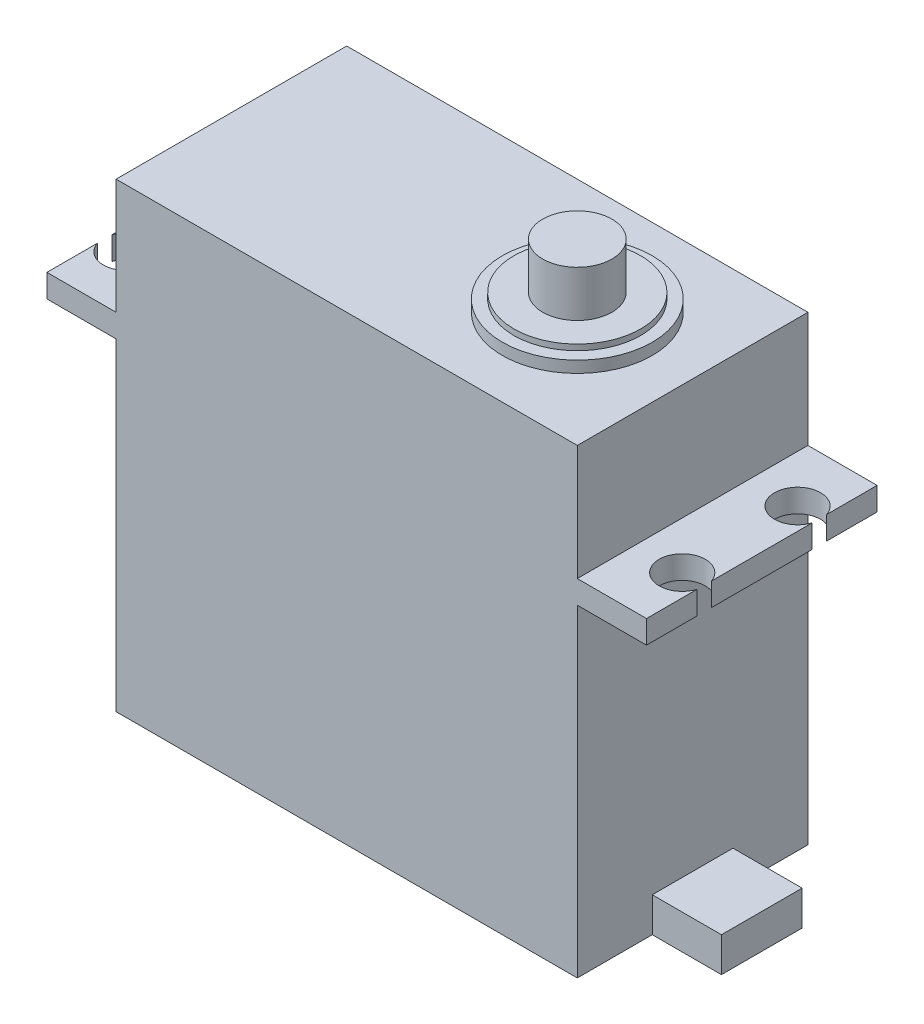
ISO-10303-21;
HEADER;
FILE_DESCRIPTION(('STEP AP214'),'2;1');
FILE_NAME('part.step','',(''),(''),'','','');
FILE_SCHEMA(('AUTOMOTIVE_DESIGN { 1 0 10303 214 1 1 1 1 }'));
ENDSEC;
DATA;
#1=APPLICATION_CONTEXT('core data for automotive mechanical design processes');
#2=APPLICATION_PROTOCOL_DEFINITION('international standard','automotive_design',2000,#1);
#3=PRODUCT_CONTEXT('',#1,'mechanical');
#4=PRODUCT('Part','Part','',(#3));
#5=PRODUCT_RELATED_PRODUCT_CATEGORY('part','',(#4));
#6=PRODUCT_DEFINITION_FORMATION('','',#4);
#7=PRODUCT_DEFINITION_CONTEXT('part definition',#1,'design');
#8=PRODUCT_DEFINITION('design','',#6,#7);
#9=PRODUCT_DEFINITION_SHAPE('','',#8);
#10=(LENGTH_UNIT() NAMED_UNIT(*) SI_UNIT(.MILLI.,.METRE.));
#11=(NAMED_UNIT(*) PLANE_ANGLE_UNIT() SI_UNIT($,.RADIAN.));
#12=(NAMED_UNIT(*) SI_UNIT($,.STERADIAN.) SOLID_ANGLE_UNIT());
#13=UNCERTAINTY_MEASURE_WITH_UNIT(LENGTH_MEASURE(1.E-05),#10,'distance_accuracy_value','');
#14=(GEOMETRIC_REPRESENTATION_CONTEXT(3) GLOBAL_UNCERTAINTY_ASSIGNED_CONTEXT((#13)) GLOBAL_UNIT_ASSIGNED_CONTEXT((#10,
#11,#12)) REPRESENTATION_CONTEXT('',''));
#15=CARTESIAN_POINT('',(0.,0.,0.));
#16=DIRECTION('',(0.,0.,1.));
#17=DIRECTION('',(1.,0.,0.));
#18=AXIS2_PLACEMENT_3D('',#15,#16,#17);
#19=CARTESIAN_POINT('',(26.,0.,0.));
#20=DIRECTION('',(1.,0.,0.));
#21=DIRECTION('',(0.,0.,-1.));
#22=AXIS2_PLACEMENT_3D('',#19,#20,#21);
#23=PLANE('',#22);
#24=DIRECTION('',(0.,1.,0.));
#25=VECTOR('',#24,1.);
#26=CARTESIAN_POINT('',(26.,24.,4.37550020016015));
#27=LINE('',#26,#25);
#28=CARTESIAN_POINT('',(26.,28.,4.37550020016015));
#29=VERTEX_POINT('',#28);
#30=CARTESIAN_POINT('',(26.,30.,4.37550020016015));
#31=VERTEX_POINT('',#30);
#32=EDGE_CURVE('E306',#29,#31,#27,.T.);
#33=ORIENTED_EDGE('',*,*,#32,.F.);
#34=DIRECTION('',(0.,0.,-1.));
#35=VECTOR('',#34,1.);
#36=CARTESIAN_POINT('',(26.,28.,10.));
#37=LINE('',#36,#35);
#38=CARTESIAN_POINT('',(26.,28.,-4.37550020016015));
#39=VERTEX_POINT('',#38);
#40=EDGE_CURVE('E384',#29,#39,#37,.T.);
#41=ORIENTED_EDGE('',*,*,#40,.T.);
#42=DIRECTION('',(0.,1.,0.));
#43=VECTOR('',#42,1.);
#44=CARTESIAN_POINT('',(26.,24.,-4.37550020016015));
#45=LINE('',#44,#43);
#46=CARTESIAN_POINT('',(26.,30.,-4.37550020016015));
#47=VERTEX_POINT('',#46);
#48=EDGE_CURVE('E313',#47,#39,#45,.F.);
#49=ORIENTED_EDGE('',*,*,#48,.F.);
#50=DIRECTION('',(0.,0.,1.));
#51=VECTOR('',#50,1.);
#52=CARTESIAN_POINT('',(26.,30.,10.));
#53=LINE('',#52,#51);
#54=EDGE_CURVE('E377',#47,#31,#53,.T.);
#55=ORIENTED_EDGE('',*,*,#54,.T.);
#56=EDGE_LOOP('',(#33,#41,#49,#55));
#57=FACE_BOUND('',#56,.T.);
#58=ADVANCED_FACE('F34',(#57),#23,.T.);
#59=DIRECTION('',(0.,1.,0.));
#60=VECTOR('',#59,1.);
#61=CARTESIAN_POINT('',(26.,24.,-5.62449979983985));
#62=LINE('',#61,#60);
#63=CARTESIAN_POINT('',(26.,28.,-5.62449979983985));
#64=VERTEX_POINT('',#63);
#65=CARTESIAN_POINT('',(26.,30.,-5.62449979983985));
#66=VERTEX_POINT('',#65);
#67=EDGE_CURVE('E309',#64,#66,#62,.T.);
#68=ORIENTED_EDGE('',*,*,#67,.F.);
#69=CARTESIAN_POINT('',(26.,28.,-10.));
#70=VERTEX_POINT('',#69);
#71=EDGE_CURVE('E385',#64,#70,#37,.T.);
#72=ORIENTED_EDGE('',*,*,#71,.T.);
#73=DIRECTION('',(0.,1.,0.));
#74=VECTOR('',#73,1.);
#75=CARTESIAN_POINT('',(26.,30.,-10.));
#76=LINE('',#75,#74);
#77=CARTESIAN_POINT('',(26.,30.,-10.));
#78=VERTEX_POINT('',#77);
#79=EDGE_CURVE('E379',#70,#78,#76,.T.);
#80=ORIENTED_EDGE('',*,*,#79,.T.);
#81=EDGE_CURVE('E366',#78,#66,#53,.T.);
#82=ORIENTED_EDGE('',*,*,#81,.T.);
#83=EDGE_LOOP('',(#68,#72,#80,#82));
#84=FACE_BOUND('',#83,.T.);
#85=ADVANCED_FACE('F451',(#84),#23,.T.);
#86=CARTESIAN_POINT('',(-26.,0.,0.));
#87=DIRECTION('',(-1.,0.,0.));
#88=DIRECTION('',(0.,0.,1.));
#89=AXIS2_PLACEMENT_3D('',#86,#87,#88);
#90=PLANE('',#89);
#91=DIRECTION('',(0.,1.,0.));
#92=VECTOR('',#91,1.);
#93=CARTESIAN_POINT('',(-26.,24.,-4.37550020016015));
#94=LINE('',#93,#92);
#95=CARTESIAN_POINT('',(-26.,28.,-4.37550020016015));
#96=VERTEX_POINT('',#95);
#97=CARTESIAN_POINT('',(-26.,30.,-4.37550020016015));
#98=VERTEX_POINT('',#97);
#99=EDGE_CURVE('E315',#96,#98,#94,.T.);
#100=ORIENTED_EDGE('',*,*,#99,.F.);
#101=DIRECTION('',(0.,0.,1.));
#102=VECTOR('',#101,1.);
#103=CARTESIAN_POINT('',(-26.,28.,-10.));
#104=LINE('',#103,#102);
#105=CARTESIAN_POINT('',(-26.,28.,4.37550020016015));
#106=VERTEX_POINT('',#105);
#107=EDGE_CURVE('E240',#96,#106,#104,.T.);
#108=ORIENTED_EDGE('',*,*,#107,.T.);
#109=DIRECTION('',(0.,1.,0.));
#110=VECTOR('',#109,1.);
#111=CARTESIAN_POINT('',(-26.,24.,4.37550020016015));
#112=LINE('',#111,#110);
#113=CARTESIAN_POINT('',(-26.,30.,4.37550020016015));
#114=VERTEX_POINT('',#113);
#115=EDGE_CURVE('E207',#114,#106,#112,.F.);
#116=ORIENTED_EDGE('',*,*,#115,.F.);
#117=DIRECTION('',(0.,0.,-1.));
#118=VECTOR('',#117,1.);
#119=CARTESIAN_POINT('',(-26.,30.,-10.));
#120=LINE('',#119,#118);
#121=EDGE_CURVE('E218',#114,#98,#120,.T.);
#122=ORIENTED_EDGE('',*,*,#121,.T.);
#123=EDGE_LOOP('',(#100,#108,#116,#122));
#124=FACE_BOUND('',#123,.T.);
#125=ADVANCED_FACE('F449',(#124),#90,.T.);
#126=DIRECTION('',(0.,1.,0.));
#127=VECTOR('',#126,1.);
#128=CARTESIAN_POINT('',(-26.,24.,5.62449979983985));
#129=LINE('',#128,#127);
#130=CARTESIAN_POINT('',(-26.,28.,5.62449979983985));
#131=VERTEX_POINT('',#130);
#132=CARTESIAN_POINT('',(-26.,30.,5.62449979983985));
#133=VERTEX_POINT('',#132);
#134=EDGE_CURVE('E196',#131,#133,#129,.T.);
#135=ORIENTED_EDGE('',*,*,#134,.F.);
#136=CARTESIAN_POINT('',(-26.,28.,10.));
#137=VERTEX_POINT('',#136);
#138=EDGE_CURVE('E242',#131,#137,#104,.T.);
#139=ORIENTED_EDGE('',*,*,#138,.T.);
#140=DIRECTION('',(0.,1.,0.));
#141=VECTOR('',#140,1.);
#142=CARTESIAN_POINT('',(-26.,30.,10.));
#143=LINE('',#142,#141);
#144=CARTESIAN_POINT('',(-26.,30.,10.));
#145=VERTEX_POINT('',#144);
#146=EDGE_CURVE('E224',#137,#145,#143,.T.);
#147=ORIENTED_EDGE('',*,*,#146,.T.);
#148=EDGE_CURVE('E215',#145,#133,#120,.T.);
#149=ORIENTED_EDGE('',*,*,#148,.T.);
#150=EDGE_LOOP('',(#135,#139,#147,#149));
#151=FACE_BOUND('',#150,.T.);
#152=ADVANCED_FACE('F222',(#151),#90,.T.);
#153=CARTESIAN_POINT('',(-20.,40.,10.));
#154=DIRECTION('',(1.,0.,0.));
#155=DIRECTION('',(0.,0.,-1.));
#156=AXIS2_PLACEMENT_3D('',#153,#154,#155);
#157=PLANE('',#156);
#158=DIRECTION('',(0.,0.,-1.));
#159=VECTOR('',#158,1.);
#160=CARTESIAN_POINT('',(-20.,30.,-10.));
#161=LINE('',#160,#159);
#162=CARTESIAN_POINT('',(-20.,30.,10.));
#163=VERTEX_POINT('',#162);
#164=CARTESIAN_POINT('',(-20.,30.,-10.));
#165=VERTEX_POINT('',#164);
#166=EDGE_CURVE('E246',#163,#165,#161,.T.);
#167=ORIENTED_EDGE('',*,*,#166,.F.);
#168=DIRECTION('',(0.,-1.,0.));
#169=VECTOR('',#168,1.);
#170=CARTESIAN_POINT('',(-20.,40.,10.));
#171=LINE('',#170,#169);
#172=CARTESIAN_POINT('',(-20.,40.,10.));
#173=VERTEX_POINT('',#172);
#174=EDGE_CURVE('E326',#173,#163,#171,.T.);
#175=ORIENTED_EDGE('',*,*,#174,.F.);
#176=DIRECTION('',(0.,0.,1.));
#177=VECTOR('',#176,1.);
#178=CARTESIAN_POINT('',(-20.,40.,10.));
#179=LINE('',#178,#177);
#180=CARTESIAN_POINT('',(-20.,40.,-10.));
#181=VERTEX_POINT('',#180);
#182=EDGE_CURVE('E348',#181,#173,#179,.T.);
#183=ORIENTED_EDGE('',*,*,#182,.F.);
#184=DIRECTION('',(0.,-1.,0.));
#185=VECTOR('',#184,1.);
#186=CARTESIAN_POINT('',(-20.,40.,-10.));
#187=LINE('',#186,#185);
#188=EDGE_CURVE('E323',#181,#165,#187,.T.);
#189=ORIENTED_EDGE('',*,*,#188,.T.);
#190=EDGE_LOOP('',(#167,#175,#183,#189));
#191=FACE_BOUND('',#190,.T.);
#192=ADVANCED_FACE('F457',(#191),#157,.F.);
#193=DIRECTION('',(0.,0.,1.));
#194=VECTOR('',#193,1.);
#195=CARTESIAN_POINT('',(-20.,28.,-10.));
#196=LINE('',#195,#194);
#197=CARTESIAN_POINT('',(-20.,28.,-10.));
#198=VERTEX_POINT('',#197);
#199=CARTESIAN_POINT('',(-20.,28.,10.));
#200=VERTEX_POINT('',#199);
#201=EDGE_CURVE('E250',#198,#200,#196,.T.);
#202=ORIENTED_EDGE('',*,*,#201,.F.);
#203=CARTESIAN_POINT('',(-20.,0.,-10.));
#204=VERTEX_POINT('',#203);
#205=EDGE_CURVE('E325',#198,#204,#187,.T.);
#206=ORIENTED_EDGE('',*,*,#205,.T.);
#207=DIRECTION('',(0.,0.,1.));
#208=VECTOR('',#207,1.);
#209=CARTESIAN_POINT('',(-20.,0.,10.));
#210=LINE('',#209,#208);
#211=CARTESIAN_POINT('',(-20.,0.,10.));
#212=VERTEX_POINT('',#211);
#213=EDGE_CURVE('E337',#204,#212,#210,.T.);
#214=ORIENTED_EDGE('',*,*,#213,.T.);
#215=EDGE_CURVE('E329',#200,#212,#171,.T.);
#216=ORIENTED_EDGE('',*,*,#215,.F.);
#217=EDGE_LOOP('',(#202,#206,#214,#216));
#218=FACE_BOUND('',#217,.T.);
#219=ADVANCED_FACE('F593',(#218),#157,.F.);
#220=CARTESIAN_POINT('',(20.,40.,10.));
#221=DIRECTION('',(-1.,0.,0.));
#222=DIRECTION('',(0.,0.,1.));
#223=AXIS2_PLACEMENT_3D('',#220,#221,#222);
#224=PLANE('',#223);
#225=DIRECTION('',(0.,-1.,0.));
#226=VECTOR('',#225,1.);
#227=CARTESIAN_POINT('',(20.,3.,3.5));
#228=LINE('',#227,#226);
#229=CARTESIAN_POINT('',(20.,3.00000000000001,3.5));
#230=VERTEX_POINT('',#229);
#231=CARTESIAN_POINT('',(20.,0.,3.5));
#232=VERTEX_POINT('',#231);
#233=EDGE_CURVE('E407',#230,#232,#228,.T.);
#234=ORIENTED_EDGE('',*,*,#233,.F.);
#235=DIRECTION('',(0.,0.,1.));
#236=VECTOR('',#235,1.);
#237=CARTESIAN_POINT('',(20.,3.,3.5));
#238=LINE('',#237,#236);
#239=CARTESIAN_POINT('',(20.,3.00000000000001,-3.5));
#240=VERTEX_POINT('',#239);
#241=EDGE_CURVE('E400',#240,#230,#238,.T.);
#242=ORIENTED_EDGE('',*,*,#241,.F.);
#243=DIRECTION('',(0.,1.,0.));
#244=VECTOR('',#243,1.);
#245=CARTESIAN_POINT('',(20.,3.00000000000001,-3.5));
#246=LINE('',#245,#244);
#247=CARTESIAN_POINT('',(20.,0.,-3.5));
#248=VERTEX_POINT('',#247);
#249=EDGE_CURVE('E404',#248,#240,#246,.T.);
#250=ORIENTED_EDGE('',*,*,#249,.F.);
#251=DIRECTION('',(0.,0.,-1.));
#252=VECTOR('',#251,1.);
#253=CARTESIAN_POINT('',(20.,0.,10.));
#254=LINE('',#253,#252);
#255=CARTESIAN_POINT('',(20.,0.,-10.));
#256=VERTEX_POINT('',#255);
#257=EDGE_CURVE('E345',#248,#256,#254,.T.);
#258=ORIENTED_EDGE('',*,*,#257,.T.);
#259=DIRECTION('',(0.,-1.,0.));
#260=VECTOR('',#259,1.);
#261=CARTESIAN_POINT('',(20.,40.,-10.));
#262=LINE('',#261,#260);
#263=CARTESIAN_POINT('',(20.,28.,-10.));
#264=VERTEX_POINT('',#263);
#265=EDGE_CURVE('E322',#264,#256,#262,.T.);
#266=ORIENTED_EDGE('',*,*,#265,.F.);
#267=DIRECTION('',(0.,0.,-1.));
#268=VECTOR('',#267,1.);
#269=CARTESIAN_POINT('',(20.,28.,10.));
#270=LINE('',#269,#268);
#271=CARTESIAN_POINT('',(20.,28.,10.));
#272=VERTEX_POINT('',#271);
#273=EDGE_CURVE('E371',#272,#264,#270,.T.);
#274=ORIENTED_EDGE('',*,*,#273,.F.);
#275=DIRECTION('',(0.,-1.,0.));
#276=VECTOR('',#275,1.);
#277=CARTESIAN_POINT('',(20.,40.,10.));
#278=LINE('',#277,#276);
#279=CARTESIAN_POINT('',(20.,0.,10.));
#280=VERTEX_POINT('',#279);
#281=EDGE_CURVE('E332',#272,#280,#278,.T.);
#282=ORIENTED_EDGE('',*,*,#281,.T.);
#283=EDGE_CURVE('E343',#280,#232,#254,.T.);
#284=ORIENTED_EDGE('',*,*,#283,.T.);
#285=EDGE_LOOP('',(#234,#242,#250,#258,#266,#274,#282,#284));
#286=FACE_BOUND('',#285,.T.);
#287=ADVANCED_FACE('F585',(#286),#224,.F.);
#288=DIRECTION('',(0.,0.,1.));
#289=VECTOR('',#288,1.);
#290=CARTESIAN_POINT('',(20.,30.,10.));
#291=LINE('',#290,#289);
#292=CARTESIAN_POINT('',(20.,30.,-10.));
#293=VERTEX_POINT('',#292);
#294=CARTESIAN_POINT('',(20.,30.,10.));
#295=VERTEX_POINT('',#294);
#296=EDGE_CURVE('E367',#293,#295,#291,.T.);
#297=ORIENTED_EDGE('',*,*,#296,.F.);
#298=CARTESIAN_POINT('',(20.,40.,-10.));
#299=VERTEX_POINT('',#298);
#300=EDGE_CURVE('E319',#299,#293,#262,.T.);
#301=ORIENTED_EDGE('',*,*,#300,.F.);
#302=DIRECTION('',(0.,0.,-1.));
#303=VECTOR('',#302,1.);
#304=CARTESIAN_POINT('',(20.,40.,10.));
#305=LINE('',#304,#303);
#306=CARTESIAN_POINT('',(20.,40.,10.));
#307=VERTEX_POINT('',#306);
#308=EDGE_CURVE('E336',#307,#299,#305,.T.);
#309=ORIENTED_EDGE('',*,*,#308,.F.);
#310=EDGE_CURVE('E330',#307,#295,#278,.T.);
#311=ORIENTED_EDGE('',*,*,#310,.T.);
#312=EDGE_LOOP('',(#297,#301,#309,#311));
#313=FACE_BOUND('',#312,.T.);
#314=ADVANCED_FACE('F36',(#313),#224,.F.);
#315=CARTESIAN_POINT('',(-20.,40.,-10.));
#316=DIRECTION('',(0.,0.,1.));
#317=DIRECTION('',(1.,0.,0.));
#318=AXIS2_PLACEMENT_3D('',#315,#316,#317);
#319=PLANE('',#318);
#320=DIRECTION('',(-1.,0.,0.));
#321=VECTOR('',#320,1.);
#322=CARTESIAN_POINT('',(-20.,0.,-10.));
#323=LINE('',#322,#321);
#324=EDGE_CURVE('E340',#256,#204,#323,.T.);
#325=ORIENTED_EDGE('',*,*,#324,.T.);
#326=ORIENTED_EDGE('',*,*,#205,.F.);
#327=DIRECTION('',(1.,0.,0.));
#328=VECTOR('',#327,1.);
#329=CARTESIAN_POINT('',(-26.,28.,-10.));
#330=LINE('',#329,#328);
#331=CARTESIAN_POINT('',(-26.,28.,-10.));
#332=VERTEX_POINT('',#331);
#333=EDGE_CURVE('E410',#332,#198,#330,.T.);
#334=ORIENTED_EDGE('',*,*,#333,.F.);
#335=DIRECTION('',(0.,-1.,0.));
#336=VECTOR('',#335,1.);
#337=CARTESIAN_POINT('',(-26.,30.,-10.));
#338=LINE('',#337,#336);
#339=CARTESIAN_POINT('',(-26.,30.,-10.));
#340=VERTEX_POINT('',#339);
#341=EDGE_CURVE('E244',#340,#332,#338,.T.);
#342=ORIENTED_EDGE('',*,*,#341,.F.);
#343=DIRECTION('',(1.,0.,0.));
#344=VECTOR('',#343,1.);
#345=CARTESIAN_POINT('',(-26.,30.,-10.));
#346=LINE('',#345,#344);
#347=EDGE_CURVE('E226',#340,#165,#346,.T.);
#348=ORIENTED_EDGE('',*,*,#347,.T.);
#349=ORIENTED_EDGE('',*,*,#188,.F.);
#350=DIRECTION('',(-1.,0.,0.));
#351=VECTOR('',#350,1.);
#352=CARTESIAN_POINT('',(-20.,40.,-10.));
#353=LINE('',#352,#351);
#354=EDGE_CURVE('E350',#299,#181,#353,.T.);
#355=ORIENTED_EDGE('',*,*,#354,.F.);
#356=ORIENTED_EDGE('',*,*,#300,.T.);
#357=DIRECTION('',(-1.,0.,0.));
#358=VECTOR('',#357,1.);
#359=CARTESIAN_POINT('',(26.,30.,-10.));
#360=LINE('',#359,#358);
#361=EDGE_CURVE('E360',#78,#293,#360,.T.);
#362=ORIENTED_EDGE('',*,*,#361,.F.);
#363=ORIENTED_EDGE('',*,*,#79,.F.);
#364=DIRECTION('',(-1.,0.,0.));
#365=VECTOR('',#364,1.);
#366=CARTESIAN_POINT('',(26.,28.,-10.));
#367=LINE('',#366,#365);
#368=EDGE_CURVE('E357',#70,#264,#367,.T.);
#369=ORIENTED_EDGE('',*,*,#368,.T.);
#370=ORIENTED_EDGE('',*,*,#265,.T.);
#371=EDGE_LOOP('',(#325,#326,#334,#342,#348,#349,#355,#356,#362,#363,#369,#370));
#372=FACE_BOUND('',#371,.T.);
#373=ADVANCED_FACE('F441',(#372),#319,.F.);
#374=CARTESIAN_POINT('',(-20.,40.,10.));
#375=DIRECTION('',(0.,0.,-1.));
#376=DIRECTION('',(-1.,0.,0.));
#377=AXIS2_PLACEMENT_3D('',#374,#375,#376);
#378=PLANE('',#377);
#379=DIRECTION('',(1.,0.,0.));
#380=VECTOR('',#379,1.);
#381=CARTESIAN_POINT('',(-20.,0.,10.));
#382=LINE('',#381,#380);
#383=EDGE_CURVE('E333',#212,#280,#382,.T.);
#384=ORIENTED_EDGE('',*,*,#383,.T.);
#385=ORIENTED_EDGE('',*,*,#281,.F.);
#386=DIRECTION('',(-1.,0.,0.));
#387=VECTOR('',#386,1.);
#388=CARTESIAN_POINT('',(26.,28.,10.));
#389=LINE('',#388,#387);
#390=CARTESIAN_POINT('',(26.,28.,10.));
#391=VERTEX_POINT('',#390);
#392=EDGE_CURVE('E354',#391,#272,#389,.T.);
#393=ORIENTED_EDGE('',*,*,#392,.F.);
#394=DIRECTION('',(0.,-1.,0.));
#395=VECTOR('',#394,1.);
#396=CARTESIAN_POINT('',(26.,30.,10.));
#397=LINE('',#396,#395);
#398=CARTESIAN_POINT('',(26.,30.,10.));
#399=VERTEX_POINT('',#398);
#400=EDGE_CURVE('E370',#399,#391,#397,.T.);
#401=ORIENTED_EDGE('',*,*,#400,.F.);
#402=DIRECTION('',(-1.,0.,0.));
#403=VECTOR('',#402,1.);
#404=CARTESIAN_POINT('',(26.,30.,10.));
#405=LINE('',#404,#403);
#406=EDGE_CURVE('E363',#399,#295,#405,.T.);
#407=ORIENTED_EDGE('',*,*,#406,.T.);
#408=ORIENTED_EDGE('',*,*,#310,.F.);
#409=DIRECTION('',(1.,0.,0.));
#410=VECTOR('',#409,1.);
#411=CARTESIAN_POINT('',(-20.,40.,10.));
#412=LINE('',#411,#410);
#413=EDGE_CURVE('E346',#173,#307,#412,.T.);
#414=ORIENTED_EDGE('',*,*,#413,.F.);
#415=ORIENTED_EDGE('',*,*,#174,.T.);
#416=DIRECTION('',(1.,0.,0.));
#417=VECTOR('',#416,1.);
#418=CARTESIAN_POINT('',(-26.,30.,10.));
#419=LINE('',#418,#417);
#420=EDGE_CURVE('E230',#145,#163,#419,.T.);
#421=ORIENTED_EDGE('',*,*,#420,.F.);
#422=ORIENTED_EDGE('',*,*,#146,.F.);
#423=DIRECTION('',(1.,0.,0.));
#424=VECTOR('',#423,1.);
#425=CARTESIAN_POINT('',(-26.,28.,10.));
#426=LINE('',#425,#424);
#427=EDGE_CURVE('E420',#137,#200,#426,.T.);
#428=ORIENTED_EDGE('',*,*,#427,.T.);
#429=ORIENTED_EDGE('',*,*,#215,.T.);
#430=EDGE_LOOP('',(#384,#385,#393,#401,#407,#408,#414,#415,#421,#422,#428,#429));
#431=FACE_BOUND('',#430,.T.);
#432=ADVANCED_FACE('F434',(#431),#378,.F.);
#433=CARTESIAN_POINT('',(0.,40.,0.));
#434=DIRECTION('',(0.,-1.,0.));
#435=DIRECTION('',(0.,0.,-1.));
#436=AXIS2_PLACEMENT_3D('',#433,#434,#435);
#437=PLANE('',#436);
#438=CARTESIAN_POINT('',(10.,40.,0.));
#439=DIRECTION('',(0.,-1.,0.));
#440=DIRECTION('',(0.,0.,-1.));
#441=AXIS2_PLACEMENT_3D('',#438,#439,#440);
#442=CIRCLE('',#441,6.5);
#443=CARTESIAN_POINT('',(10.,40.,-6.5));
#444=VERTEX_POINT('',#443);
#445=EDGE_CURVE('E38',#444,#444,#442,.F.);
#446=ORIENTED_EDGE('',*,*,#445,.F.);
#447=EDGE_LOOP('',(#446));
#448=FACE_BOUND('',#447,.T.);
#449=ORIENTED_EDGE('',*,*,#308,.T.);
#450=ORIENTED_EDGE('',*,*,#354,.T.);
#451=ORIENTED_EDGE('',*,*,#182,.T.);
#452=ORIENTED_EDGE('',*,*,#413,.T.);
#453=EDGE_LOOP('',(#449,#450,#451,#452));
#454=FACE_BOUND('',#453,.T.);
#455=ADVANCED_FACE('F570',(#448,#454),#437,.F.);
#456=CARTESIAN_POINT('',(0.,0.,0.));
#457=DIRECTION('',(0.,-1.,0.));
#458=DIRECTION('',(0.,0.,-1.));
#459=AXIS2_PLACEMENT_3D('',#456,#457,#458);
#460=PLANE('',#459);
#461=ORIENTED_EDGE('',*,*,#283,.F.);
#462=ORIENTED_EDGE('',*,*,#383,.F.);
#463=ORIENTED_EDGE('',*,*,#213,.F.);
#464=ORIENTED_EDGE('',*,*,#324,.F.);
#465=ORIENTED_EDGE('',*,*,#257,.F.);
#466=DIRECTION('',(-1.,0.,0.));
#467=VECTOR('',#466,1.);
#468=CARTESIAN_POINT('',(26.,0.,-3.5));
#469=LINE('',#468,#467);
#470=CARTESIAN_POINT('',(26.,0.,-3.5));
#471=VERTEX_POINT('',#470);
#472=EDGE_CURVE('E390',#471,#248,#469,.T.);
#473=ORIENTED_EDGE('',*,*,#472,.F.);
#474=DIRECTION('',(0.,0.,-1.));
#475=VECTOR('',#474,1.);
#476=CARTESIAN_POINT('',(26.,0.,3.50000000000001));
#477=LINE('',#476,#475);
#478=CARTESIAN_POINT('',(26.,0.,3.50000000000001));
#479=VERTEX_POINT('',#478);
#480=EDGE_CURVE('E414',#479,#471,#477,.T.);
#481=ORIENTED_EDGE('',*,*,#480,.F.);
#482=DIRECTION('',(-1.,0.,0.));
#483=VECTOR('',#482,1.);
#484=CARTESIAN_POINT('',(26.,0.,3.50000000000001));
#485=LINE('',#484,#483);
#486=EDGE_CURVE('E374',#479,#232,#485,.T.);
#487=ORIENTED_EDGE('',*,*,#486,.T.);
#488=EDGE_LOOP('',(#461,#462,#463,#464,#465,#473,#481,#487));
#489=FACE_BOUND('',#488,.T.);
#490=ADVANCED_FACE('F565',(#489),#460,.T.);
#491=CARTESIAN_POINT('',(26.,28.,10.));
#492=DIRECTION('',(0.,1.,0.));
#493=DIRECTION('',(0.,0.,1.));
#494=AXIS2_PLACEMENT_3D('',#491,#492,#493);
#495=PLANE('',#494);
#496=ORIENTED_EDGE('',*,*,#40,.F.);
#497=CARTESIAN_POINT('',(24.1,28.,5.));
#498=DIRECTION('',(0.,1.,0.));
#499=DIRECTION('',(0.,0.,1.));
#500=AXIS2_PLACEMENT_3D('',#497,#498,#499);
#501=CIRCLE('',#500,2.);
#502=CARTESIAN_POINT('',(26.,28.,5.62449979983985));
#503=VERTEX_POINT('',#502);
#504=EDGE_CURVE('E247',#29,#503,#501,.T.);
#505=ORIENTED_EDGE('',*,*,#504,.T.);
#506=EDGE_CURVE('E381',#391,#503,#37,.T.);
#507=ORIENTED_EDGE('',*,*,#506,.F.);
#508=ORIENTED_EDGE('',*,*,#392,.T.);
#509=ORIENTED_EDGE('',*,*,#273,.T.);
#510=ORIENTED_EDGE('',*,*,#368,.F.);
#511=ORIENTED_EDGE('',*,*,#71,.F.);
#512=CARTESIAN_POINT('',(24.1,28.,-5.));
#513=DIRECTION('',(0.,1.,0.));
#514=DIRECTION('',(0.,0.,1.));
#515=AXIS2_PLACEMENT_3D('',#512,#513,#514);
#516=CIRCLE('',#515,2.);
#517=EDGE_CURVE('E251',#64,#39,#516,.T.);
#518=ORIENTED_EDGE('',*,*,#517,.T.);
#519=EDGE_LOOP('',(#496,#505,#507,#508,#509,#510,#511,#518));
#520=FACE_BOUND('',#519,.T.);
#521=ADVANCED_FACE('F480',(#520),#495,.F.);
#522=CARTESIAN_POINT('',(26.,30.,10.));
#523=DIRECTION('',(0.,-1.,0.));
#524=DIRECTION('',(0.,0.,-1.));
#525=AXIS2_PLACEMENT_3D('',#522,#523,#524);
#526=PLANE('',#525);
#527=CARTESIAN_POINT('',(26.,30.,5.62449979983985));
#528=VERTEX_POINT('',#527);
#529=EDGE_CURVE('E378',#528,#399,#53,.T.);
#530=ORIENTED_EDGE('',*,*,#529,.F.);
#531=CARTESIAN_POINT('',(24.1,30.,5.));
#532=DIRECTION('',(0.,1.,0.));
#533=DIRECTION('',(0.,0.,1.));
#534=AXIS2_PLACEMENT_3D('',#531,#532,#533);
#535=CIRCLE('',#534,2.);
#536=EDGE_CURVE('E51',#31,#528,#535,.T.);
#537=ORIENTED_EDGE('',*,*,#536,.F.);
#538=ORIENTED_EDGE('',*,*,#54,.F.);
#539=CARTESIAN_POINT('',(24.1,30.,-5.));
#540=DIRECTION('',(0.,1.,0.));
#541=DIRECTION('',(0.,0.,1.));
#542=AXIS2_PLACEMENT_3D('',#539,#540,#541);
#543=CIRCLE('',#542,2.);
#544=EDGE_CURVE('E59',#66,#47,#543,.T.);
#545=ORIENTED_EDGE('',*,*,#544,.F.);
#546=ORIENTED_EDGE('',*,*,#81,.F.);
#547=ORIENTED_EDGE('',*,*,#361,.T.);
#548=ORIENTED_EDGE('',*,*,#296,.T.);
#549=ORIENTED_EDGE('',*,*,#406,.F.);
#550=EDGE_LOOP('',(#530,#537,#538,#545,#546,#547,#548,#549));
#551=FACE_BOUND('',#550,.T.);
#552=ADVANCED_FACE('F472',(#551),#526,.F.);
#553=DIRECTION('',(0.,1.,0.));
#554=VECTOR('',#553,1.);
#555=CARTESIAN_POINT('',(26.,24.,5.62449979983985));
#556=LINE('',#555,#554);
#557=EDGE_CURVE('E307',#528,#503,#556,.F.);
#558=ORIENTED_EDGE('',*,*,#557,.F.);
#559=ORIENTED_EDGE('',*,*,#529,.T.);
#560=ORIENTED_EDGE('',*,*,#400,.T.);
#561=ORIENTED_EDGE('',*,*,#506,.T.);
#562=EDGE_LOOP('',(#558,#559,#560,#561));
#563=FACE_BOUND('',#562,.T.);
#564=ADVANCED_FACE('F460',(#563),#23,.T.);
#565=CARTESIAN_POINT('',(26.,3.,3.5));
#566=DIRECTION('',(0.,0.,-1.));
#567=DIRECTION('',(0.,1.,0.));
#568=AXIS2_PLACEMENT_3D('',#565,#566,#567);
#569=PLANE('',#568);
#570=ORIENTED_EDGE('',*,*,#233,.T.);
#571=ORIENTED_EDGE('',*,*,#486,.F.);
#572=DIRECTION('',(0.,-1.,0.));
#573=VECTOR('',#572,1.);
#574=CARTESIAN_POINT('',(26.,3.,3.5));
#575=LINE('',#574,#573);
#576=CARTESIAN_POINT('',(26.,3.,3.5));
#577=VERTEX_POINT('',#576);
#578=EDGE_CURVE('E403',#577,#479,#575,.T.);
#579=ORIENTED_EDGE('',*,*,#578,.F.);
#580=DIRECTION('',(-1.,0.,0.));
#581=VECTOR('',#580,1.);
#582=CARTESIAN_POINT('',(26.,3.,3.5));
#583=LINE('',#582,#581);
#584=EDGE_CURVE('E396',#577,#230,#583,.T.);
#585=ORIENTED_EDGE('',*,*,#584,.T.);
#586=EDGE_LOOP('',(#570,#571,#579,#585));
#587=FACE_BOUND('',#586,.T.);
#588=ADVANCED_FACE('F471',(#587),#569,.F.);
#589=CARTESIAN_POINT('',(26.,3.00000000000001,-3.5));
#590=DIRECTION('',(0.,0.,1.));
#591=DIRECTION('',(1.,0.,0.));
#592=AXIS2_PLACEMENT_3D('',#589,#590,#591);
#593=PLANE('',#592);
#594=ORIENTED_EDGE('',*,*,#249,.T.);
#595=DIRECTION('',(-1.,0.,0.));
#596=VECTOR('',#595,1.);
#597=CARTESIAN_POINT('',(26.,3.00000000000001,-3.5));
#598=LINE('',#597,#596);
#599=CARTESIAN_POINT('',(26.,3.00000000000001,-3.5));
#600=VERTEX_POINT('',#599);
#601=EDGE_CURVE('E393',#600,#240,#598,.T.);
#602=ORIENTED_EDGE('',*,*,#601,.F.);
#603=DIRECTION('',(0.,1.,0.));
#604=VECTOR('',#603,1.);
#605=CARTESIAN_POINT('',(26.,3.00000000000001,-3.5));
#606=LINE('',#605,#604);
#607=EDGE_CURVE('E412',#471,#600,#606,.T.);
#608=ORIENTED_EDGE('',*,*,#607,.F.);
#609=ORIENTED_EDGE('',*,*,#472,.T.);
#610=EDGE_LOOP('',(#594,#602,#608,#609));
#611=FACE_BOUND('',#610,.T.);
#612=ADVANCED_FACE('F478',(#611),#593,.F.);
#613=CARTESIAN_POINT('',(26.,3.,3.5));
#614=DIRECTION('',(0.,-1.,0.));
#615=DIRECTION('',(0.,0.,-1.));
#616=AXIS2_PLACEMENT_3D('',#613,#614,#615);
#617=PLANE('',#616);
#618=ORIENTED_EDGE('',*,*,#241,.T.);
#619=ORIENTED_EDGE('',*,*,#584,.F.);
#620=DIRECTION('',(0.,0.,1.));
#621=VECTOR('',#620,1.);
#622=CARTESIAN_POINT('',(26.,3.,3.5));
#623=LINE('',#622,#621);
#624=EDGE_CURVE('E399',#600,#577,#623,.T.);
#625=ORIENTED_EDGE('',*,*,#624,.F.);
#626=ORIENTED_EDGE('',*,*,#601,.T.);
#627=EDGE_LOOP('',(#618,#619,#625,#626));
#628=FACE_BOUND('',#627,.T.);
#629=ADVANCED_FACE('F538',(#628),#617,.F.);
#630=CARTESIAN_POINT('',(26.,0.,0.));
#631=DIRECTION('',(1.,0.,0.));
#632=DIRECTION('',(0.,0.,-1.));
#633=AXIS2_PLACEMENT_3D('',#630,#631,#632);
#634=PLANE('',#633);
#635=ORIENTED_EDGE('',*,*,#578,.T.);
#636=ORIENTED_EDGE('',*,*,#480,.T.);
#637=ORIENTED_EDGE('',*,*,#607,.T.);
#638=ORIENTED_EDGE('',*,*,#624,.T.);
#639=EDGE_LOOP('',(#635,#636,#637,#638));
#640=FACE_BOUND('',#639,.T.);
#641=ADVANCED_FACE('F531',(#640),#634,.T.);
#642=CARTESIAN_POINT('',(-26.,28.,-10.));
#643=DIRECTION('',(0.,1.,0.));
#644=DIRECTION('',(0.,0.,1.));
#645=AXIS2_PLACEMENT_3D('',#642,#643,#644);
#646=PLANE('',#645);
#647=ORIENTED_EDGE('',*,*,#107,.F.);
#648=CARTESIAN_POINT('',(-24.1,28.,-5.));
#649=DIRECTION('',(0.,1.,0.));
#650=DIRECTION('',(0.,0.,1.));
#651=AXIS2_PLACEMENT_3D('',#648,#649,#650);
#652=CIRCLE('',#651,2.);
#653=CARTESIAN_POINT('',(-26.,28.,-5.62449979983985));
#654=VERTEX_POINT('',#653);
#655=EDGE_CURVE('E254',#96,#654,#652,.T.);
#656=ORIENTED_EDGE('',*,*,#655,.T.);
#657=EDGE_CURVE('E238',#332,#654,#104,.T.);
#658=ORIENTED_EDGE('',*,*,#657,.F.);
#659=ORIENTED_EDGE('',*,*,#333,.T.);
#660=ORIENTED_EDGE('',*,*,#201,.T.);
#661=ORIENTED_EDGE('',*,*,#427,.F.);
#662=ORIENTED_EDGE('',*,*,#138,.F.);
#663=CARTESIAN_POINT('',(-24.1,28.,5.));
#664=DIRECTION('',(0.,1.,0.));
#665=DIRECTION('',(0.,0.,1.));
#666=AXIS2_PLACEMENT_3D('',#663,#664,#665);
#667=CIRCLE('',#666,2.);
#668=EDGE_CURVE('E202',#131,#106,#667,.T.);
#669=ORIENTED_EDGE('',*,*,#668,.T.);
#670=EDGE_LOOP('',(#647,#656,#658,#659,#660,#661,#662,#669));
#671=FACE_BOUND('',#670,.T.);
#672=ADVANCED_FACE('F429',(#671),#646,.F.);
#673=CARTESIAN_POINT('',(-26.,30.,-10.));
#674=DIRECTION('',(0.,-1.,0.));
#675=DIRECTION('',(0.,0.,-1.));
#676=AXIS2_PLACEMENT_3D('',#673,#674,#675);
#677=PLANE('',#676);
#678=CARTESIAN_POINT('',(-26.,30.,-5.62449979983985));
#679=VERTEX_POINT('',#678);
#680=EDGE_CURVE('E228',#679,#340,#120,.T.);
#681=ORIENTED_EDGE('',*,*,#680,.F.);
#682=CARTESIAN_POINT('',(-24.1,30.,-5.));
#683=DIRECTION('',(0.,1.,0.));
#684=DIRECTION('',(0.,0.,1.));
#685=AXIS2_PLACEMENT_3D('',#682,#683,#684);
#686=CIRCLE('',#685,2.);
#687=EDGE_CURVE('E219',#98,#679,#686,.T.);
#688=ORIENTED_EDGE('',*,*,#687,.F.);
#689=ORIENTED_EDGE('',*,*,#121,.F.);
#690=CARTESIAN_POINT('',(-24.1,30.,5.));
#691=DIRECTION('',(0.,1.,0.));
#692=DIRECTION('',(0.,0.,1.));
#693=AXIS2_PLACEMENT_3D('',#690,#691,#692);
#694=CIRCLE('',#693,2.);
#695=EDGE_CURVE('E199',#133,#114,#694,.T.);
#696=ORIENTED_EDGE('',*,*,#695,.F.);
#697=ORIENTED_EDGE('',*,*,#148,.F.);
#698=ORIENTED_EDGE('',*,*,#420,.T.);
#699=ORIENTED_EDGE('',*,*,#166,.T.);
#700=ORIENTED_EDGE('',*,*,#347,.F.);
#701=EDGE_LOOP('',(#681,#688,#689,#696,#697,#698,#699,#700));
#702=FACE_BOUND('',#701,.T.);
#703=ADVANCED_FACE('F213',(#702),#677,.F.);
#704=DIRECTION('',(0.,1.,0.));
#705=VECTOR('',#704,1.);
#706=CARTESIAN_POINT('',(-26.,24.,-5.62449979983985));
#707=LINE('',#706,#705);
#708=EDGE_CURVE('E206',#679,#654,#707,.F.);
#709=ORIENTED_EDGE('',*,*,#708,.F.);
#710=ORIENTED_EDGE('',*,*,#680,.T.);
#711=ORIENTED_EDGE('',*,*,#341,.T.);
#712=ORIENTED_EDGE('',*,*,#657,.T.);
#713=EDGE_LOOP('',(#709,#710,#711,#712));
#714=FACE_BOUND('',#713,.T.);
#715=ADVANCED_FACE('F443',(#714),#90,.T.);
#716=CARTESIAN_POINT('',(-24.1,24.,5.));
#717=DIRECTION('',(0.,1.,0.));
#718=DIRECTION('',(0.,0.,1.));
#719=AXIS2_PLACEMENT_3D('',#716,#717,#718);
#720=CYLINDRICAL_SURFACE('',#719,2.);
#721=ORIENTED_EDGE('',*,*,#134,.T.);
#722=ORIENTED_EDGE('',*,*,#695,.T.);
#723=ORIENTED_EDGE('',*,*,#115,.T.);
#724=ORIENTED_EDGE('',*,*,#668,.F.);
#725=EDGE_LOOP('',(#721,#722,#723,#724));
#726=FACE_BOUND('',#725,.T.);
#727=ADVANCED_FACE('F198',(#726),#720,.F.);
#728=CARTESIAN_POINT('',(-24.1,24.,-5.));
#729=DIRECTION('',(0.,1.,0.));
#730=DIRECTION('',(0.,0.,1.));
#731=AXIS2_PLACEMENT_3D('',#728,#729,#730);
#732=CYLINDRICAL_SURFACE('',#731,2.);
#733=ORIENTED_EDGE('',*,*,#99,.T.);
#734=ORIENTED_EDGE('',*,*,#687,.T.);
#735=ORIENTED_EDGE('',*,*,#708,.T.);
#736=ORIENTED_EDGE('',*,*,#655,.F.);
#737=EDGE_LOOP('',(#733,#734,#735,#736));
#738=FACE_BOUND('',#737,.T.);
#739=ADVANCED_FACE('F447',(#738),#732,.F.);
#740=CARTESIAN_POINT('',(24.1,24.,-5.));
#741=DIRECTION('',(0.,1.,0.));
#742=DIRECTION('',(0.,0.,1.));
#743=AXIS2_PLACEMENT_3D('',#740,#741,#742);
#744=CYLINDRICAL_SURFACE('',#743,2.);
#745=ORIENTED_EDGE('',*,*,#67,.T.);
#746=ORIENTED_EDGE('',*,*,#544,.T.);
#747=ORIENTED_EDGE('',*,*,#48,.T.);
#748=ORIENTED_EDGE('',*,*,#517,.F.);
#749=EDGE_LOOP('',(#745,#746,#747,#748));
#750=FACE_BOUND('',#749,.T.);
#751=ADVANCED_FACE('F503',(#750),#744,.F.);
#752=CARTESIAN_POINT('',(24.1,24.,5.));
#753=DIRECTION('',(0.,1.,0.));
#754=DIRECTION('',(0.,0.,1.));
#755=AXIS2_PLACEMENT_3D('',#752,#753,#754);
#756=CYLINDRICAL_SURFACE('',#755,2.);
#757=ORIENTED_EDGE('',*,*,#32,.T.);
#758=ORIENTED_EDGE('',*,*,#536,.T.);
#759=ORIENTED_EDGE('',*,*,#557,.T.);
#760=ORIENTED_EDGE('',*,*,#504,.F.);
#761=EDGE_LOOP('',(#757,#758,#759,#760));
#762=FACE_BOUND('',#761,.T.);
#763=ADVANCED_FACE('F301',(#762),#756,.F.);
#764=CARTESIAN_POINT('',(10.,41.,0.));
#765=DIRECTION('',(0.,-1.,0.));
#766=DIRECTION('',(0.,0.,-1.));
#767=AXIS2_PLACEMENT_3D('',#764,#765,#766);
#768=CYLINDRICAL_SURFACE('',#767,6.5);
#769=CARTESIAN_POINT('',(10.,41.,0.));
#770=DIRECTION('',(0.,1.,0.));
#771=DIRECTION('',(0.,0.,1.));
#772=AXIS2_PLACEMENT_3D('',#769,#770,#771);
#773=CIRCLE('',#772,6.5);
#774=CARTESIAN_POINT('',(10.,41.,6.5));
#775=VERTEX_POINT('',#774);
#776=EDGE_CURVE('E220',#775,#775,#773,.T.);
#777=ORIENTED_EDGE('',*,*,#776,.F.);
#778=EDGE_LOOP('',(#777));
#779=FACE_BOUND('',#778,.T.);
#780=ORIENTED_EDGE('',*,*,#445,.T.);
#781=EDGE_LOOP('',(#780));
#782=FACE_BOUND('',#781,.T.);
#783=ADVANCED_FACE('F295',(#779,#782),#768,.T.);
#784=CARTESIAN_POINT('',(10.,41.,0.));
#785=DIRECTION('',(0.,1.,0.));
#786=DIRECTION('',(0.,0.,1.));
#787=AXIS2_PLACEMENT_3D('',#784,#785,#786);
#788=PLANE('',#787);
#789=CARTESIAN_POINT('',(10.,41.,0.));
#790=DIRECTION('',(0.,1.,0.));
#791=DIRECTION('',(0.,0.,1.));
#792=AXIS2_PLACEMENT_3D('',#789,#790,#791);
#793=CIRCLE('',#792,5.5);
#794=CARTESIAN_POINT('',(10.,41.,5.5));
#795=VERTEX_POINT('',#794);
#796=EDGE_CURVE('E43',#795,#795,#793,.T.);
#797=ORIENTED_EDGE('',*,*,#796,.F.);
#798=EDGE_LOOP('',(#797));
#799=FACE_BOUND('',#798,.T.);
#800=ORIENTED_EDGE('',*,*,#776,.T.);
#801=EDGE_LOOP('',(#800));
#802=FACE_BOUND('',#801,.T.);
#803=ADVANCED_FACE('F289',(#799,#802),#788,.T.);
#804=CARTESIAN_POINT('',(10.,41.5,0.));
#805=DIRECTION('',(0.,-1.,0.));
#806=DIRECTION('',(0.,0.,-1.));
#807=AXIS2_PLACEMENT_3D('',#804,#805,#806);
#808=CYLINDRICAL_SURFACE('',#807,5.5);
#809=CARTESIAN_POINT('',(10.,41.5,0.));
#810=DIRECTION('',(0.,1.,0.));
#811=DIRECTION('',(0.,0.,1.));
#812=AXIS2_PLACEMENT_3D('',#809,#810,#811);
#813=CIRCLE('',#812,5.5);
#814=CARTESIAN_POINT('',(10.,41.5,5.5));
#815=VERTEX_POINT('',#814);
#816=EDGE_CURVE('E263',#815,#815,#813,.T.);
#817=ORIENTED_EDGE('',*,*,#816,.F.);
#818=EDGE_LOOP('',(#817));
#819=FACE_BOUND('',#818,.T.);
#820=ORIENTED_EDGE('',*,*,#796,.T.);
#821=EDGE_LOOP('',(#820));
#822=FACE_BOUND('',#821,.T.);
#823=ADVANCED_FACE('F283',(#819,#822),#808,.T.);
#824=CARTESIAN_POINT('',(10.,41.5,0.));
#825=DIRECTION('',(0.,1.,0.));
#826=DIRECTION('',(0.,0.,1.));
#827=AXIS2_PLACEMENT_3D('',#824,#825,#826);
#828=PLANE('',#827);
#829=CARTESIAN_POINT('',(10.,41.5,0.));
#830=DIRECTION('',(0.,1.,0.));
#831=DIRECTION('',(0.,0.,1.));
#832=AXIS2_PLACEMENT_3D('',#829,#830,#831);
#833=CIRCLE('',#832,3.);
#834=CARTESIAN_POINT('',(10.,41.5,3.));
#835=VERTEX_POINT('',#834);
#836=EDGE_CURVE('E11',#835,#835,#833,.T.);
#837=ORIENTED_EDGE('',*,*,#836,.F.);
#838=EDGE_LOOP('',(#837));
#839=FACE_BOUND('',#838,.T.);
#840=ORIENTED_EDGE('',*,*,#816,.T.);
#841=EDGE_LOOP('',(#840));
#842=FACE_BOUND('',#841,.T.);
#843=ADVANCED_FACE('F277',(#839,#842),#828,.T.);
#844=CARTESIAN_POINT('',(10.,45.5,0.));
#845=DIRECTION('',(0.,-1.,0.));
#846=DIRECTION('',(0.,0.,-1.));
#847=AXIS2_PLACEMENT_3D('',#844,#845,#846);
#848=CYLINDRICAL_SURFACE('',#847,3.);
#849=CARTESIAN_POINT('',(10.,45.5,0.));
#850=DIRECTION('',(0.,1.,0.));
#851=DIRECTION('',(0.,0.,1.));
#852=AXIS2_PLACEMENT_3D('',#849,#850,#851);
#853=CIRCLE('',#852,3.);
#854=CARTESIAN_POINT('',(10.,45.5,3.));
#855=VERTEX_POINT('',#854);
#856=EDGE_CURVE('E267',#855,#855,#853,.T.);
#857=ORIENTED_EDGE('',*,*,#856,.F.);
#858=EDGE_LOOP('',(#857));
#859=FACE_BOUND('',#858,.T.);
#860=ORIENTED_EDGE('',*,*,#836,.T.);
#861=EDGE_LOOP('',(#860));
#862=FACE_BOUND('',#861,.T.);
#863=ADVANCED_FACE('F274',(#859,#862),#848,.T.);
#864=CARTESIAN_POINT('',(10.,45.5,0.));
#865=DIRECTION('',(0.,1.,0.));
#866=DIRECTION('',(0.,0.,1.));
#867=AXIS2_PLACEMENT_3D('',#864,#865,#866);
#868=PLANE('',#867);
#869=ORIENTED_EDGE('',*,*,#856,.T.);
#870=EDGE_LOOP('',(#869));
#871=FACE_BOUND('',#870,.T.);
#872=ADVANCED_FACE('F272',(#871),#868,.T.);
#873=CLOSED_SHELL('',(#58,#85,#125,#152,#192,#219,#287,#314,#373,#432,#455,#490,#521,#552,#564,
#588,#612,#629,#641,#672,#703,#715,#727,#739,#751,#763,#783,#803,#823,#843,#863,#872));
#874=MANIFOLD_SOLID_BREP('B2',#873);
#875=ADVANCED_BREP_SHAPE_REPRESENTATION('',(#18,#874),#14);
#876=SHAPE_DEFINITION_REPRESENTATION(#9,#875);
ENDSEC;
END-ISO-10303-21;
